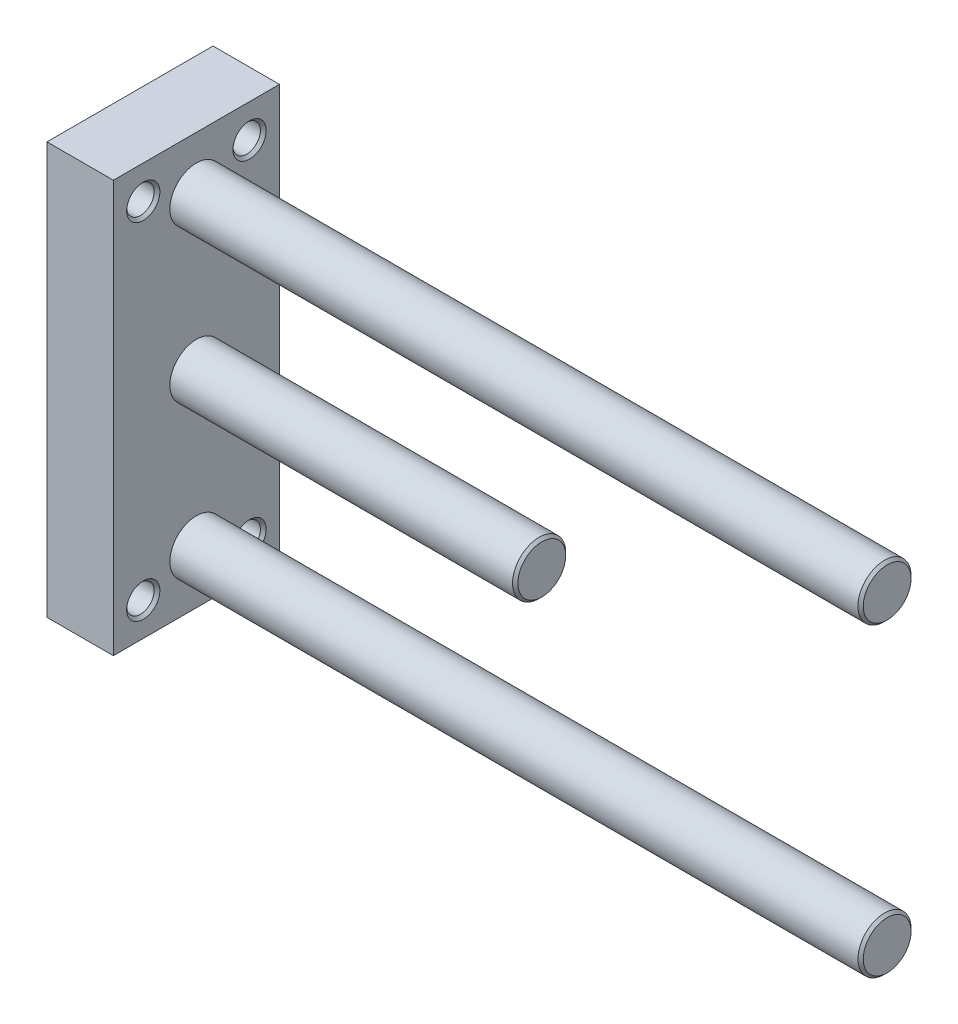
ISO-10303-21;
HEADER;
FILE_DESCRIPTION(('STEP AP214'),'2;1');
FILE_NAME('part.step','',(''),(''),'','','');
FILE_SCHEMA(('AUTOMOTIVE_DESIGN { 1 0 10303 214 1 1 1 1 }'));
ENDSEC;
DATA;
#1=APPLICATION_CONTEXT('core data for automotive mechanical design processes');
#2=APPLICATION_PROTOCOL_DEFINITION('international standard','automotive_design',2000,#1);
#3=PRODUCT_CONTEXT('',#1,'mechanical');
#4=PRODUCT('Part','Part','',(#3));
#5=PRODUCT_RELATED_PRODUCT_CATEGORY('part','',(#4));
#6=PRODUCT_DEFINITION_FORMATION('','',#4);
#7=PRODUCT_DEFINITION_CONTEXT('part definition',#1,'design');
#8=PRODUCT_DEFINITION('design','',#6,#7);
#9=PRODUCT_DEFINITION_SHAPE('','',#8);
#10=(LENGTH_UNIT() NAMED_UNIT(*) SI_UNIT(.MILLI.,.METRE.));
#11=(NAMED_UNIT(*) PLANE_ANGLE_UNIT() SI_UNIT($,.RADIAN.));
#12=(NAMED_UNIT(*) SI_UNIT($,.STERADIAN.) SOLID_ANGLE_UNIT());
#13=UNCERTAINTY_MEASURE_WITH_UNIT(LENGTH_MEASURE(1.E-05),#10,'distance_accuracy_value','');
#14=(GEOMETRIC_REPRESENTATION_CONTEXT(3) GLOBAL_UNCERTAINTY_ASSIGNED_CONTEXT((#13)) GLOBAL_UNIT_ASSIGNED_CONTEXT((#10,
#11,#12)) REPRESENTATION_CONTEXT('',''));
#15=CARTESIAN_POINT('',(0.,0.,0.));
#16=DIRECTION('',(0.,0.,1.));
#17=DIRECTION('',(1.,0.,0.));
#18=AXIS2_PLACEMENT_3D('',#15,#16,#17);
#19=CARTESIAN_POINT('',(10.,-31.,12.5));
#20=DIRECTION('',(1.,0.,0.));
#21=DIRECTION('',(0.,0.,-1.));
#22=AXIS2_PLACEMENT_3D('',#19,#20,#21);
#23=PLANE('',#22);
#24=CARTESIAN_POINT('',(9.99999999999999,-23.,0.));
#25=DIRECTION('',(-1.,0.,0.));
#26=DIRECTION('',(0.,0.,1.));
#27=AXIS2_PLACEMENT_3D('',#24,#25,#26);
#28=CIRCLE('',#27,4.);
#29=CARTESIAN_POINT('',(9.99999999999999,-23.,4.));
#30=VERTEX_POINT('',#29);
#31=EDGE_CURVE('E205',#30,#30,#28,.T.);
#32=ORIENTED_EDGE('',*,*,#31,.T.);
#33=EDGE_LOOP('',(#32));
#34=FACE_BOUND('',#33,.T.);
#35=CARTESIAN_POINT('',(10.,26.,8.));
#36=DIRECTION('',(-1.,0.,0.));
#37=DIRECTION('',(0.,0.,1.));
#38=AXIS2_PLACEMENT_3D('',#35,#36,#37);
#39=CIRCLE('',#38,2.5);
#40=CARTESIAN_POINT('',(10.,26.,10.5));
#41=VERTEX_POINT('',#40);
#42=EDGE_CURVE('E276',#41,#41,#39,.T.);
#43=ORIENTED_EDGE('',*,*,#42,.T.);
#44=EDGE_LOOP('',(#43));
#45=FACE_BOUND('',#44,.T.);
#46=CARTESIAN_POINT('',(10.,-26.,-8.));
#47=DIRECTION('',(-1.,0.,0.));
#48=DIRECTION('',(0.,0.,1.));
#49=AXIS2_PLACEMENT_3D('',#46,#47,#48);
#50=CIRCLE('',#49,2.5);
#51=CARTESIAN_POINT('',(10.,-26.,-5.5));
#52=VERTEX_POINT('',#51);
#53=EDGE_CURVE('E298',#52,#52,#50,.T.);
#54=ORIENTED_EDGE('',*,*,#53,.T.);
#55=EDGE_LOOP('',(#54));
#56=FACE_BOUND('',#55,.T.);
#57=DIRECTION('',(0.,-1.,0.));
#58=VECTOR('',#57,1.);
#59=CARTESIAN_POINT('',(10.,31.,12.5));
#60=LINE('',#59,#58);
#61=CARTESIAN_POINT('',(10.,31.,12.5));
#62=VERTEX_POINT('',#61);
#63=CARTESIAN_POINT('',(10.,-31.,12.5));
#64=VERTEX_POINT('',#63);
#65=EDGE_CURVE('E154',#62,#64,#60,.T.);
#66=ORIENTED_EDGE('',*,*,#65,.T.);
#67=DIRECTION('',(0.,0.,-1.));
#68=VECTOR('',#67,1.);
#69=CARTESIAN_POINT('',(10.,-31.,12.5));
#70=LINE('',#69,#68);
#71=CARTESIAN_POINT('',(10.,-31.,-12.5));
#72=VERTEX_POINT('',#71);
#73=EDGE_CURVE('E87',#64,#72,#70,.T.);
#74=ORIENTED_EDGE('',*,*,#73,.T.);
#75=DIRECTION('',(0.,1.,0.));
#76=VECTOR('',#75,1.);
#77=CARTESIAN_POINT('',(10.,-31.,-12.5));
#78=LINE('',#77,#76);
#79=CARTESIAN_POINT('',(10.,31.,-12.5));
#80=VERTEX_POINT('',#79);
#81=EDGE_CURVE('E150',#72,#80,#78,.T.);
#82=ORIENTED_EDGE('',*,*,#81,.T.);
#83=DIRECTION('',(0.,0.,1.));
#84=VECTOR('',#83,1.);
#85=CARTESIAN_POINT('',(10.,31.,-12.5));
#86=LINE('',#85,#84);
#87=EDGE_CURVE('E56',#80,#62,#86,.T.);
#88=ORIENTED_EDGE('',*,*,#87,.T.);
#89=EDGE_LOOP('',(#66,#74,#82,#88));
#90=FACE_BOUND('',#89,.T.);
#91=CARTESIAN_POINT('',(10.,26.,-8.));
#92=DIRECTION('',(-1.,0.,0.));
#93=DIRECTION('',(0.,0.,1.));
#94=AXIS2_PLACEMENT_3D('',#91,#92,#93);
#95=CIRCLE('',#94,2.5);
#96=CARTESIAN_POINT('',(10.,26.,-5.5));
#97=VERTEX_POINT('',#96);
#98=EDGE_CURVE('E179',#97,#97,#95,.T.);
#99=ORIENTED_EDGE('',*,*,#98,.T.);
#100=EDGE_LOOP('',(#99));
#101=FACE_BOUND('',#100,.T.);
#102=CARTESIAN_POINT('',(10.,-26.,8.));
#103=DIRECTION('',(-1.,0.,0.));
#104=DIRECTION('',(0.,0.,1.));
#105=AXIS2_PLACEMENT_3D('',#102,#103,#104);
#106=CIRCLE('',#105,2.5);
#107=CARTESIAN_POINT('',(10.,-26.,10.5));
#108=VERTEX_POINT('',#107);
#109=EDGE_CURVE('E183',#108,#108,#106,.T.);
#110=ORIENTED_EDGE('',*,*,#109,.T.);
#111=EDGE_LOOP('',(#110));
#112=FACE_BOUND('',#111,.T.);
#113=CARTESIAN_POINT('',(10.,0.,0.));
#114=DIRECTION('',(-1.,0.,0.));
#115=DIRECTION('',(0.,0.,1.));
#116=AXIS2_PLACEMENT_3D('',#113,#114,#115);
#117=CIRCLE('',#116,4.);
#118=CARTESIAN_POINT('',(10.,0.,4.));
#119=VERTEX_POINT('',#118);
#120=EDGE_CURVE('E187',#119,#119,#117,.T.);
#121=ORIENTED_EDGE('',*,*,#120,.T.);
#122=EDGE_LOOP('',(#121));
#123=FACE_BOUND('',#122,.T.);
#124=CARTESIAN_POINT('',(9.99999999999999,23.,0.));
#125=DIRECTION('',(-1.,0.,0.));
#126=DIRECTION('',(0.,0.,1.));
#127=AXIS2_PLACEMENT_3D('',#124,#125,#126);
#128=CIRCLE('',#127,4.);
#129=CARTESIAN_POINT('',(9.99999999999999,23.,4.));
#130=VERTEX_POINT('',#129);
#131=EDGE_CURVE('E190',#130,#130,#128,.T.);
#132=ORIENTED_EDGE('',*,*,#131,.T.);
#133=EDGE_LOOP('',(#132));
#134=FACE_BOUND('',#133,.T.);
#135=ADVANCED_FACE('F39',(#34,#45,#56,#90,#101,#112,#123,#134),#23,.T.);
#136=CARTESIAN_POINT('',(0.,-31.,12.5));
#137=DIRECTION('',(1.,0.,0.));
#138=DIRECTION('',(0.,0.,-1.));
#139=AXIS2_PLACEMENT_3D('',#136,#137,#138);
#140=PLANE('',#139);
#141=CARTESIAN_POINT('',(0.,0.,0.));
#142=DIRECTION('',(-1.,0.,0.));
#143=DIRECTION('',(0.,0.,1.));
#144=AXIS2_PLACEMENT_3D('',#141,#142,#143);
#145=CIRCLE('',#144,3.8);
#146=CARTESIAN_POINT('',(0.,0.,3.8));
#147=VERTEX_POINT('',#146);
#148=EDGE_CURVE('E252',#147,#147,#145,.T.);
#149=ORIENTED_EDGE('',*,*,#148,.F.);
#150=EDGE_LOOP('',(#149));
#151=FACE_BOUND('',#150,.T.);
#152=CARTESIAN_POINT('',(0.,26.,8.));
#153=DIRECTION('',(-1.,0.,0.));
#154=DIRECTION('',(0.,0.,1.));
#155=AXIS2_PLACEMENT_3D('',#152,#153,#154);
#156=CIRCLE('',#155,2.5);
#157=CARTESIAN_POINT('',(0.,26.,10.5));
#158=VERTEX_POINT('',#157);
#159=EDGE_CURVE('E285',#158,#158,#156,.T.);
#160=ORIENTED_EDGE('',*,*,#159,.F.);
#161=EDGE_LOOP('',(#160));
#162=FACE_BOUND('',#161,.T.);
#163=CARTESIAN_POINT('',(0.,-26.,-8.));
#164=DIRECTION('',(-1.,0.,0.));
#165=DIRECTION('',(0.,0.,1.));
#166=AXIS2_PLACEMENT_3D('',#163,#164,#165);
#167=CIRCLE('',#166,2.5);
#168=CARTESIAN_POINT('',(0.,-26.,-5.5));
#169=VERTEX_POINT('',#168);
#170=EDGE_CURVE('E307',#169,#169,#167,.T.);
#171=ORIENTED_EDGE('',*,*,#170,.F.);
#172=EDGE_LOOP('',(#171));
#173=FACE_BOUND('',#172,.T.);
#174=DIRECTION('',(0.,-1.,0.));
#175=VECTOR('',#174,1.);
#176=CARTESIAN_POINT('',(0.,31.,12.5));
#177=LINE('',#176,#175);
#178=CARTESIAN_POINT('',(0.,31.,12.5));
#179=VERTEX_POINT('',#178);
#180=CARTESIAN_POINT('',(0.,-31.,12.5));
#181=VERTEX_POINT('',#180);
#182=EDGE_CURVE('E148',#179,#181,#177,.T.);
#183=ORIENTED_EDGE('',*,*,#182,.F.);
#184=DIRECTION('',(0.,0.,1.));
#185=VECTOR('',#184,1.);
#186=CARTESIAN_POINT('',(0.,31.,-12.5));
#187=LINE('',#186,#185);
#188=CARTESIAN_POINT('',(0.,31.,-12.5));
#189=VERTEX_POINT('',#188);
#190=EDGE_CURVE('E80',#189,#179,#187,.T.);
#191=ORIENTED_EDGE('',*,*,#190,.F.);
#192=DIRECTION('',(0.,1.,0.));
#193=VECTOR('',#192,1.);
#194=CARTESIAN_POINT('',(0.,-31.,-12.5));
#195=LINE('',#194,#193);
#196=CARTESIAN_POINT('',(0.,-31.,-12.5));
#197=VERTEX_POINT('',#196);
#198=EDGE_CURVE('E74',#197,#189,#195,.T.);
#199=ORIENTED_EDGE('',*,*,#198,.F.);
#200=DIRECTION('',(0.,0.,-1.));
#201=VECTOR('',#200,1.);
#202=CARTESIAN_POINT('',(0.,-31.,12.5));
#203=LINE('',#202,#201);
#204=EDGE_CURVE('E142',#181,#197,#203,.T.);
#205=ORIENTED_EDGE('',*,*,#204,.F.);
#206=EDGE_LOOP('',(#183,#191,#199,#205));
#207=FACE_BOUND('',#206,.T.);
#208=CARTESIAN_POINT('',(0.,26.,-8.));
#209=DIRECTION('',(-1.,0.,0.));
#210=DIRECTION('',(0.,0.,1.));
#211=AXIS2_PLACEMENT_3D('',#208,#209,#210);
#212=CIRCLE('',#211,2.5);
#213=CARTESIAN_POINT('',(0.,26.,-5.5));
#214=VERTEX_POINT('',#213);
#215=EDGE_CURVE('E164',#214,#214,#212,.T.);
#216=ORIENTED_EDGE('',*,*,#215,.F.);
#217=EDGE_LOOP('',(#216));
#218=FACE_BOUND('',#217,.T.);
#219=CARTESIAN_POINT('',(0.,-26.,8.));
#220=DIRECTION('',(-1.,0.,0.));
#221=DIRECTION('',(0.,0.,1.));
#222=AXIS2_PLACEMENT_3D('',#219,#220,#221);
#223=CIRCLE('',#222,2.5);
#224=CARTESIAN_POINT('',(0.,-26.,10.5));
#225=VERTEX_POINT('',#224);
#226=EDGE_CURVE('E295',#225,#225,#223,.T.);
#227=ORIENTED_EDGE('',*,*,#226,.F.);
#228=EDGE_LOOP('',(#227));
#229=FACE_BOUND('',#228,.T.);
#230=CARTESIAN_POINT('',(0.,23.,0.));
#231=DIRECTION('',(-1.,0.,0.));
#232=DIRECTION('',(0.,0.,1.));
#233=AXIS2_PLACEMENT_3D('',#230,#231,#232);
#234=CIRCLE('',#233,3.8);
#235=CARTESIAN_POINT('',(0.,23.,3.8));
#236=VERTEX_POINT('',#235);
#237=EDGE_CURVE('E273',#236,#236,#234,.T.);
#238=ORIENTED_EDGE('',*,*,#237,.F.);
#239=EDGE_LOOP('',(#238));
#240=FACE_BOUND('',#239,.T.);
#241=CARTESIAN_POINT('',(0.,-23.,0.));
#242=DIRECTION('',(-1.,0.,0.));
#243=DIRECTION('',(0.,0.,1.));
#244=AXIS2_PLACEMENT_3D('',#241,#242,#243);
#245=CIRCLE('',#244,3.8);
#246=CARTESIAN_POINT('',(0.,-23.,3.8));
#247=VERTEX_POINT('',#246);
#248=EDGE_CURVE('E231',#247,#247,#245,.T.);
#249=ORIENTED_EDGE('',*,*,#248,.F.);
#250=EDGE_LOOP('',(#249));
#251=FACE_BOUND('',#250,.T.);
#252=ADVANCED_FACE('F115',(#151,#162,#173,#207,#218,#229,#240,#251),#140,.F.);
#253=CARTESIAN_POINT('',(10.,31.,12.5));
#254=DIRECTION('',(0.,0.,-1.));
#255=DIRECTION('',(-1.,0.,0.));
#256=AXIS2_PLACEMENT_3D('',#253,#254,#255);
#257=PLANE('',#256);
#258=ORIENTED_EDGE('',*,*,#182,.T.);
#259=DIRECTION('',(-1.,0.,0.));
#260=VECTOR('',#259,1.);
#261=CARTESIAN_POINT('',(10.,-31.,12.5));
#262=LINE('',#261,#260);
#263=EDGE_CURVE('E11',#64,#181,#262,.T.);
#264=ORIENTED_EDGE('',*,*,#263,.F.);
#265=ORIENTED_EDGE('',*,*,#65,.F.);
#266=DIRECTION('',(-1.,0.,0.));
#267=VECTOR('',#266,1.);
#268=CARTESIAN_POINT('',(10.,31.,12.5));
#269=LINE('',#268,#267);
#270=EDGE_CURVE('E158',#62,#179,#269,.T.);
#271=ORIENTED_EDGE('',*,*,#270,.T.);
#272=EDGE_LOOP('',(#258,#264,#265,#271));
#273=FACE_BOUND('',#272,.T.);
#274=ADVANCED_FACE('F41',(#273),#257,.F.);
#275=CARTESIAN_POINT('',(10.,-31.,12.5));
#276=DIRECTION('',(0.,1.,0.));
#277=DIRECTION('',(0.,0.,1.));
#278=AXIS2_PLACEMENT_3D('',#275,#276,#277);
#279=PLANE('',#278);
#280=ORIENTED_EDGE('',*,*,#204,.T.);
#281=DIRECTION('',(-1.,0.,0.));
#282=VECTOR('',#281,1.);
#283=CARTESIAN_POINT('',(10.,-31.,-12.5));
#284=LINE('',#283,#282);
#285=EDGE_CURVE('E48',#72,#197,#284,.T.);
#286=ORIENTED_EDGE('',*,*,#285,.F.);
#287=ORIENTED_EDGE('',*,*,#73,.F.);
#288=ORIENTED_EDGE('',*,*,#263,.T.);
#289=EDGE_LOOP('',(#280,#286,#287,#288));
#290=FACE_BOUND('',#289,.T.);
#291=ADVANCED_FACE('F136',(#290),#279,.F.);
#292=CARTESIAN_POINT('',(10.,-31.,-12.5));
#293=DIRECTION('',(0.,0.,1.));
#294=DIRECTION('',(1.,0.,0.));
#295=AXIS2_PLACEMENT_3D('',#292,#293,#294);
#296=PLANE('',#295);
#297=ORIENTED_EDGE('',*,*,#198,.T.);
#298=DIRECTION('',(-1.,0.,0.));
#299=VECTOR('',#298,1.);
#300=CARTESIAN_POINT('',(10.,31.,-12.5));
#301=LINE('',#300,#299);
#302=EDGE_CURVE('E151',#80,#189,#301,.T.);
#303=ORIENTED_EDGE('',*,*,#302,.F.);
#304=ORIENTED_EDGE('',*,*,#81,.F.);
#305=ORIENTED_EDGE('',*,*,#285,.T.);
#306=EDGE_LOOP('',(#297,#303,#304,#305));
#307=FACE_BOUND('',#306,.T.);
#308=ADVANCED_FACE('F134',(#307),#296,.F.);
#309=CARTESIAN_POINT('',(10.,31.,-12.5));
#310=DIRECTION('',(0.,-1.,0.));
#311=DIRECTION('',(0.,0.,-1.));
#312=AXIS2_PLACEMENT_3D('',#309,#310,#311);
#313=PLANE('',#312);
#314=ORIENTED_EDGE('',*,*,#190,.T.);
#315=ORIENTED_EDGE('',*,*,#270,.F.);
#316=ORIENTED_EDGE('',*,*,#87,.F.);
#317=ORIENTED_EDGE('',*,*,#302,.T.);
#318=EDGE_LOOP('',(#314,#315,#316,#317));
#319=FACE_BOUND('',#318,.T.);
#320=ADVANCED_FACE('F131',(#319),#313,.F.);
#321=CARTESIAN_POINT('',(0.432999999999999,26.,-8.));
#322=DIRECTION('',(-1.,0.,0.));
#323=DIRECTION('',(0.,0.,1.));
#324=AXIS2_PLACEMENT_3D('',#321,#322,#323);
#325=CONICAL_SURFACE('',#324,2.067,0.78539816339745);
#326=ORIENTED_EDGE('',*,*,#215,.T.);
#327=EDGE_LOOP('',(#326));
#328=FACE_BOUND('',#327,.T.);
#329=CARTESIAN_POINT('',(0.432999999999999,26.,-8.));
#330=DIRECTION('',(-1.,0.,0.));
#331=DIRECTION('',(0.,0.,1.));
#332=AXIS2_PLACEMENT_3D('',#329,#330,#331);
#333=CIRCLE('',#332,2.067);
#334=CARTESIAN_POINT('',(0.432999999999999,26.,-5.933));
#335=VERTEX_POINT('',#334);
#336=EDGE_CURVE('E166',#335,#335,#333,.T.);
#337=ORIENTED_EDGE('',*,*,#336,.F.);
#338=EDGE_LOOP('',(#337));
#339=FACE_BOUND('',#338,.T.);
#340=ADVANCED_FACE('F128',(#328,#339),#325,.F.);
#341=CARTESIAN_POINT('',(10.,26.,-8.));
#342=DIRECTION('',(-1.,0.,0.));
#343=DIRECTION('',(0.,0.,1.));
#344=AXIS2_PLACEMENT_3D('',#341,#342,#343);
#345=CYLINDRICAL_SURFACE('',#344,2.067);
#346=ORIENTED_EDGE('',*,*,#336,.T.);
#347=EDGE_LOOP('',(#346));
#348=FACE_BOUND('',#347,.T.);
#349=CARTESIAN_POINT('',(9.567,26.,-8.));
#350=DIRECTION('',(-1.,0.,0.));
#351=DIRECTION('',(0.,0.,1.));
#352=AXIS2_PLACEMENT_3D('',#349,#350,#351);
#353=CIRCLE('',#352,2.067);
#354=CARTESIAN_POINT('',(9.567,26.,-5.933));
#355=VERTEX_POINT('',#354);
#356=EDGE_CURVE('E171',#355,#355,#353,.T.);
#357=ORIENTED_EDGE('',*,*,#356,.F.);
#358=EDGE_LOOP('',(#357));
#359=FACE_BOUND('',#358,.T.);
#360=ADVANCED_FACE('F316',(#348,#359),#345,.F.);
#361=CARTESIAN_POINT('',(10.,26.,-8.));
#362=DIRECTION('',(1.,0.,0.));
#363=DIRECTION('',(0.,0.,-1.));
#364=AXIS2_PLACEMENT_3D('',#361,#362,#363);
#365=CONICAL_SURFACE('',#364,2.5,0.78539816339745);
#366=ORIENTED_EDGE('',*,*,#356,.T.);
#367=EDGE_LOOP('',(#366));
#368=FACE_BOUND('',#367,.T.);
#369=ORIENTED_EDGE('',*,*,#98,.F.);
#370=EDGE_LOOP('',(#369));
#371=FACE_BOUND('',#370,.T.);
#372=ADVANCED_FACE('F313',(#368,#371),#365,.F.);
#373=CARTESIAN_POINT('',(0.432999999999999,-26.,-8.));
#374=DIRECTION('',(-1.,0.,0.));
#375=DIRECTION('',(0.,0.,1.));
#376=AXIS2_PLACEMENT_3D('',#373,#374,#375);
#377=CONICAL_SURFACE('',#376,2.067,0.78539816339745);
#378=ORIENTED_EDGE('',*,*,#170,.T.);
#379=EDGE_LOOP('',(#378));
#380=FACE_BOUND('',#379,.T.);
#381=CARTESIAN_POINT('',(0.432999999999999,-26.,-8.));
#382=DIRECTION('',(-1.,0.,0.));
#383=DIRECTION('',(0.,0.,1.));
#384=AXIS2_PLACEMENT_3D('',#381,#382,#383);
#385=CIRCLE('',#384,2.067);
#386=CARTESIAN_POINT('',(0.432999999999999,-26.,-5.933));
#387=VERTEX_POINT('',#386);
#388=EDGE_CURVE('E304',#387,#387,#385,.T.);
#389=ORIENTED_EDGE('',*,*,#388,.F.);
#390=EDGE_LOOP('',(#389));
#391=FACE_BOUND('',#390,.T.);
#392=ADVANCED_FACE('F323',(#380,#391),#377,.F.);
#393=CARTESIAN_POINT('',(10.,-26.,-8.));
#394=DIRECTION('',(-1.,0.,0.));
#395=DIRECTION('',(0.,0.,1.));
#396=AXIS2_PLACEMENT_3D('',#393,#394,#395);
#397=CYLINDRICAL_SURFACE('',#396,2.067);
#398=ORIENTED_EDGE('',*,*,#388,.T.);
#399=EDGE_LOOP('',(#398));
#400=FACE_BOUND('',#399,.T.);
#401=CARTESIAN_POINT('',(9.567,-26.,-8.));
#402=DIRECTION('',(-1.,0.,0.));
#403=DIRECTION('',(0.,0.,1.));
#404=AXIS2_PLACEMENT_3D('',#401,#402,#403);
#405=CIRCLE('',#404,2.067);
#406=CARTESIAN_POINT('',(9.567,-26.,-5.933));
#407=VERTEX_POINT('',#406);
#408=EDGE_CURVE('E301',#407,#407,#405,.T.);
#409=ORIENTED_EDGE('',*,*,#408,.F.);
#410=EDGE_LOOP('',(#409));
#411=FACE_BOUND('',#410,.T.);
#412=ADVANCED_FACE('F328',(#400,#411),#397,.F.);
#413=CARTESIAN_POINT('',(10.,-26.,-8.));
#414=DIRECTION('',(1.,0.,0.));
#415=DIRECTION('',(0.,0.,-1.));
#416=AXIS2_PLACEMENT_3D('',#413,#414,#415);
#417=CONICAL_SURFACE('',#416,2.5,0.78539816339745);
#418=ORIENTED_EDGE('',*,*,#408,.T.);
#419=EDGE_LOOP('',(#418));
#420=FACE_BOUND('',#419,.T.);
#421=ORIENTED_EDGE('',*,*,#53,.F.);
#422=EDGE_LOOP('',(#421));
#423=FACE_BOUND('',#422,.T.);
#424=ADVANCED_FACE('F332',(#420,#423),#417,.F.);
#425=CARTESIAN_POINT('',(0.432999999999999,-26.,8.));
#426=DIRECTION('',(-1.,0.,0.));
#427=DIRECTION('',(0.,0.,1.));
#428=AXIS2_PLACEMENT_3D('',#425,#426,#427);
#429=CONICAL_SURFACE('',#428,2.067,0.78539816339745);
#430=ORIENTED_EDGE('',*,*,#226,.T.);
#431=EDGE_LOOP('',(#430));
#432=FACE_BOUND('',#431,.T.);
#433=CARTESIAN_POINT('',(0.432999999999999,-26.,8.));
#434=DIRECTION('',(-1.,0.,0.));
#435=DIRECTION('',(0.,0.,1.));
#436=AXIS2_PLACEMENT_3D('',#433,#434,#435);
#437=CIRCLE('',#436,2.067);
#438=CARTESIAN_POINT('',(0.432999999999999,-26.,10.067));
#439=VERTEX_POINT('',#438);
#440=EDGE_CURVE('E292',#439,#439,#437,.T.);
#441=ORIENTED_EDGE('',*,*,#440,.F.);
#442=EDGE_LOOP('',(#441));
#443=FACE_BOUND('',#442,.T.);
#444=ADVANCED_FACE('F336',(#432,#443),#429,.F.);
#445=CARTESIAN_POINT('',(10.,-26.,8.));
#446=DIRECTION('',(-1.,0.,0.));
#447=DIRECTION('',(0.,0.,1.));
#448=AXIS2_PLACEMENT_3D('',#445,#446,#447);
#449=CYLINDRICAL_SURFACE('',#448,2.067);
#450=ORIENTED_EDGE('',*,*,#440,.T.);
#451=EDGE_LOOP('',(#450));
#452=FACE_BOUND('',#451,.T.);
#453=CARTESIAN_POINT('',(9.567,-26.,8.));
#454=DIRECTION('',(-1.,0.,0.));
#455=DIRECTION('',(0.,0.,1.));
#456=AXIS2_PLACEMENT_3D('',#453,#454,#455);
#457=CIRCLE('',#456,2.067);
#458=CARTESIAN_POINT('',(9.567,-26.,10.067));
#459=VERTEX_POINT('',#458);
#460=EDGE_CURVE('E289',#459,#459,#457,.T.);
#461=ORIENTED_EDGE('',*,*,#460,.F.);
#462=EDGE_LOOP('',(#461));
#463=FACE_BOUND('',#462,.T.);
#464=ADVANCED_FACE('F340',(#452,#463),#449,.F.);
#465=CARTESIAN_POINT('',(10.,-26.,8.));
#466=DIRECTION('',(1.,0.,0.));
#467=DIRECTION('',(0.,0.,-1.));
#468=AXIS2_PLACEMENT_3D('',#465,#466,#467);
#469=CONICAL_SURFACE('',#468,2.5,0.78539816339745);
#470=ORIENTED_EDGE('',*,*,#460,.T.);
#471=EDGE_LOOP('',(#470));
#472=FACE_BOUND('',#471,.T.);
#473=ORIENTED_EDGE('',*,*,#109,.F.);
#474=EDGE_LOOP('',(#473));
#475=FACE_BOUND('',#474,.T.);
#476=ADVANCED_FACE('F344',(#472,#475),#469,.F.);
#477=CARTESIAN_POINT('',(0.432999999999999,26.,8.));
#478=DIRECTION('',(-1.,0.,0.));
#479=DIRECTION('',(0.,0.,1.));
#480=AXIS2_PLACEMENT_3D('',#477,#478,#479);
#481=CONICAL_SURFACE('',#480,2.067,0.78539816339745);
#482=ORIENTED_EDGE('',*,*,#159,.T.);
#483=EDGE_LOOP('',(#482));
#484=FACE_BOUND('',#483,.T.);
#485=CARTESIAN_POINT('',(0.432999999999999,26.,8.));
#486=DIRECTION('',(-1.,0.,0.));
#487=DIRECTION('',(0.,0.,1.));
#488=AXIS2_PLACEMENT_3D('',#485,#486,#487);
#489=CIRCLE('',#488,2.067);
#490=CARTESIAN_POINT('',(0.432999999999999,26.,10.067));
#491=VERTEX_POINT('',#490);
#492=EDGE_CURVE('E282',#491,#491,#489,.T.);
#493=ORIENTED_EDGE('',*,*,#492,.F.);
#494=EDGE_LOOP('',(#493));
#495=FACE_BOUND('',#494,.T.);
#496=ADVANCED_FACE('F348',(#484,#495),#481,.F.);
#497=CARTESIAN_POINT('',(10.,26.,8.));
#498=DIRECTION('',(-1.,0.,0.));
#499=DIRECTION('',(0.,0.,1.));
#500=AXIS2_PLACEMENT_3D('',#497,#498,#499);
#501=CYLINDRICAL_SURFACE('',#500,2.067);
#502=ORIENTED_EDGE('',*,*,#492,.T.);
#503=EDGE_LOOP('',(#502));
#504=FACE_BOUND('',#503,.T.);
#505=CARTESIAN_POINT('',(9.567,26.,8.));
#506=DIRECTION('',(-1.,0.,0.));
#507=DIRECTION('',(0.,0.,1.));
#508=AXIS2_PLACEMENT_3D('',#505,#506,#507);
#509=CIRCLE('',#508,2.067);
#510=CARTESIAN_POINT('',(9.567,26.,10.067));
#511=VERTEX_POINT('',#510);
#512=EDGE_CURVE('E279',#511,#511,#509,.T.);
#513=ORIENTED_EDGE('',*,*,#512,.F.);
#514=EDGE_LOOP('',(#513));
#515=FACE_BOUND('',#514,.T.);
#516=ADVANCED_FACE('F352',(#504,#515),#501,.F.);
#517=CARTESIAN_POINT('',(10.,26.,8.));
#518=DIRECTION('',(1.,0.,0.));
#519=DIRECTION('',(0.,0.,-1.));
#520=AXIS2_PLACEMENT_3D('',#517,#518,#519);
#521=CONICAL_SURFACE('',#520,2.5,0.78539816339745);
#522=ORIENTED_EDGE('',*,*,#512,.T.);
#523=EDGE_LOOP('',(#522));
#524=FACE_BOUND('',#523,.T.);
#525=ORIENTED_EDGE('',*,*,#42,.F.);
#526=EDGE_LOOP('',(#525));
#527=FACE_BOUND('',#526,.T.);
#528=ADVANCED_FACE('F356',(#524,#527),#521,.F.);
#529=CARTESIAN_POINT('',(5.02158095934,23.,0.));
#530=DIRECTION('',(-1.,0.,0.));
#531=DIRECTION('',(0.,0.,1.));
#532=AXIS2_PLACEMENT_3D('',#529,#530,#531);
#533=CYLINDRICAL_SURFACE('',#532,3.8);
#534=ORIENTED_EDGE('',*,*,#237,.T.);
#535=EDGE_LOOP('',(#534));
#536=FACE_BOUND('',#535,.T.);
#537=CARTESIAN_POINT('',(5.5555555555556,23.,0.));
#538=DIRECTION('',(-1.,0.,0.));
#539=DIRECTION('',(0.,0.,1.));
#540=AXIS2_PLACEMENT_3D('',#537,#538,#539);
#541=CIRCLE('',#540,3.8);
#542=CARTESIAN_POINT('',(5.5555555555556,23.,3.8));
#543=VERTEX_POINT('',#542);
#544=EDGE_CURVE('E270',#543,#543,#541,.T.);
#545=ORIENTED_EDGE('',*,*,#544,.F.);
#546=EDGE_LOOP('',(#545));
#547=FACE_BOUND('',#546,.T.);
#548=ADVANCED_FACE('F360',(#536,#547),#533,.F.);
#549=CARTESIAN_POINT('',(5.5555555555556,23.,-3.8));
#550=DIRECTION('',(-1.,0.,0.));
#551=DIRECTION('',(0.,0.,1.));
#552=AXIS2_PLACEMENT_3D('',#549,#550,#551);
#553=PLANE('',#552);
#554=ORIENTED_EDGE('',*,*,#544,.T.);
#555=EDGE_LOOP('',(#554));
#556=FACE_BOUND('',#555,.T.);
#557=CARTESIAN_POINT('',(5.5555555555556,23.,0.));
#558=DIRECTION('',(-1.,0.,0.));
#559=DIRECTION('',(0.,0.,1.));
#560=AXIS2_PLACEMENT_3D('',#557,#558,#559);
#561=CIRCLE('',#560,3.5);
#562=CARTESIAN_POINT('',(5.5555555555556,23.,3.5));
#563=VERTEX_POINT('',#562);
#564=EDGE_CURVE('E267',#563,#563,#561,.T.);
#565=ORIENTED_EDGE('',*,*,#564,.F.);
#566=EDGE_LOOP('',(#565));
#567=FACE_BOUND('',#566,.T.);
#568=ADVANCED_FACE('F364',(#556,#567),#553,.T.);
#569=CARTESIAN_POINT('',(5.02158095934,23.,0.));
#570=DIRECTION('',(-1.,0.,0.));
#571=DIRECTION('',(0.,0.,1.));
#572=AXIS2_PLACEMENT_3D('',#569,#570,#571);
#573=CYLINDRICAL_SURFACE('',#572,3.5);
#574=ORIENTED_EDGE('',*,*,#564,.T.);
#575=EDGE_LOOP('',(#574));
#576=FACE_BOUND('',#575,.T.);
#577=CARTESIAN_POINT('',(2.0555555555556,23.,0.));
#578=DIRECTION('',(-1.,0.,0.));
#579=DIRECTION('',(0.,0.,1.));
#580=AXIS2_PLACEMENT_3D('',#577,#578,#579);
#581=CIRCLE('',#580,3.5);
#582=CARTESIAN_POINT('',(2.0555555555556,23.,3.5));
#583=VERTEX_POINT('',#582);
#584=EDGE_CURVE('E264',#583,#583,#581,.T.);
#585=ORIENTED_EDGE('',*,*,#584,.F.);
#586=EDGE_LOOP('',(#585));
#587=FACE_BOUND('',#586,.T.);
#588=ADVANCED_FACE('F368',(#576,#587),#573,.T.);
#589=CARTESIAN_POINT('',(1.5555555555556,23.,0.));
#590=DIRECTION('',(1.,0.,0.));
#591=DIRECTION('',(0.,0.,-1.));
#592=AXIS2_PLACEMENT_3D('',#589,#590,#591);
#593=CONICAL_SURFACE('',#592,3.,0.785398163397448);
#594=ORIENTED_EDGE('',*,*,#584,.T.);
#595=EDGE_LOOP('',(#594));
#596=FACE_BOUND('',#595,.T.);
#597=CARTESIAN_POINT('',(1.5555555555556,23.,0.));
#598=DIRECTION('',(-1.,0.,0.));
#599=DIRECTION('',(0.,0.,1.));
#600=AXIS2_PLACEMENT_3D('',#597,#598,#599);
#601=CIRCLE('',#600,3.);
#602=CARTESIAN_POINT('',(1.5555555555556,23.,3.));
#603=VERTEX_POINT('',#602);
#604=EDGE_CURVE('E261',#603,#603,#601,.T.);
#605=ORIENTED_EDGE('',*,*,#604,.F.);
#606=EDGE_LOOP('',(#605));
#607=FACE_BOUND('',#606,.T.);
#608=ADVANCED_FACE('F372',(#596,#607),#593,.T.);
#609=CARTESIAN_POINT('',(1.5555555555556,23.,-3.));
#610=DIRECTION('',(-1.,0.,0.));
#611=DIRECTION('',(0.,0.,1.));
#612=AXIS2_PLACEMENT_3D('',#609,#610,#611);
#613=PLANE('',#612);
#614=ORIENTED_EDGE('',*,*,#604,.T.);
#615=EDGE_LOOP('',(#614));
#616=FACE_BOUND('',#615,.T.);
#617=CARTESIAN_POINT('',(1.5555555555556,23.,0.));
#618=DIRECTION('',(-1.,0.,0.));
#619=DIRECTION('',(0.,0.,1.));
#620=AXIS2_PLACEMENT_3D('',#617,#618,#619);
#621=CIRCLE('',#620,1.5);
#622=CARTESIAN_POINT('',(1.5555555555556,23.,1.5));
#623=VERTEX_POINT('',#622);
#624=EDGE_CURVE('E258',#623,#623,#621,.T.);
#625=ORIENTED_EDGE('',*,*,#624,.F.);
#626=EDGE_LOOP('',(#625));
#627=FACE_BOUND('',#626,.T.);
#628=ADVANCED_FACE('F376',(#616,#627),#613,.T.);
#629=CARTESIAN_POINT('',(5.02158095934,23.,0.));
#630=DIRECTION('',(-1.,0.,0.));
#631=DIRECTION('',(0.,0.,1.));
#632=AXIS2_PLACEMENT_3D('',#629,#630,#631);
#633=CYLINDRICAL_SURFACE('',#632,1.5);
#634=ORIENTED_EDGE('',*,*,#624,.T.);
#635=EDGE_LOOP('',(#634));
#636=FACE_BOUND('',#635,.T.);
#637=CARTESIAN_POINT('',(4.1555555555556,23.,0.));
#638=DIRECTION('',(-1.,0.,0.));
#639=DIRECTION('',(0.,0.,1.));
#640=AXIS2_PLACEMENT_3D('',#637,#638,#639);
#641=CIRCLE('',#640,1.5);
#642=CARTESIAN_POINT('',(4.1555555555556,23.,1.5));
#643=VERTEX_POINT('',#642);
#644=EDGE_CURVE('E255',#643,#643,#641,.T.);
#645=ORIENTED_EDGE('',*,*,#644,.F.);
#646=EDGE_LOOP('',(#645));
#647=FACE_BOUND('',#646,.T.);
#648=ADVANCED_FACE('F380',(#636,#647),#633,.F.);
#649=CARTESIAN_POINT('',(5.02158095934,23.,0.));
#650=DIRECTION('',(-1.,0.,0.));
#651=DIRECTION('',(0.,0.,1.));
#652=AXIS2_PLACEMENT_3D('',#649,#650,#651);
#653=CONICAL_SURFACE('',#652,0.,1.04719755119662);
#654=ORIENTED_EDGE('',*,*,#644,.T.);
#655=EDGE_LOOP('',(#654));
#656=FACE_BOUND('',#655,.T.);
#657=CARTESIAN_POINT('',(5.02158095934,23.,0.));
#658=VERTEX_POINT('',#657);
#659=VERTEX_LOOP('',#658);
#660=FACE_BOUND('',#659,.T.);
#661=ADVANCED_FACE('F384',(#656,#660),#653,.F.);
#662=CARTESIAN_POINT('',(5.02158095934,0.,0.));
#663=DIRECTION('',(-1.,0.,0.));
#664=DIRECTION('',(0.,0.,1.));
#665=AXIS2_PLACEMENT_3D('',#662,#663,#664);
#666=CYLINDRICAL_SURFACE('',#665,3.8);
#667=ORIENTED_EDGE('',*,*,#148,.T.);
#668=EDGE_LOOP('',(#667));
#669=FACE_BOUND('',#668,.T.);
#670=CARTESIAN_POINT('',(5.5555555555556,0.,0.));
#671=DIRECTION('',(-1.,0.,0.));
#672=DIRECTION('',(0.,0.,1.));
#673=AXIS2_PLACEMENT_3D('',#670,#671,#672);
#674=CIRCLE('',#673,3.8);
#675=CARTESIAN_POINT('',(5.5555555555556,0.,3.8));
#676=VERTEX_POINT('',#675);
#677=EDGE_CURVE('E249',#676,#676,#674,.T.);
#678=ORIENTED_EDGE('',*,*,#677,.F.);
#679=EDGE_LOOP('',(#678));
#680=FACE_BOUND('',#679,.T.);
#681=ADVANCED_FACE('F388',(#669,#680),#666,.F.);
#682=CARTESIAN_POINT('',(5.5555555555556,0.,-3.8));
#683=DIRECTION('',(-1.,0.,0.));
#684=DIRECTION('',(0.,0.,1.));
#685=AXIS2_PLACEMENT_3D('',#682,#683,#684);
#686=PLANE('',#685);
#687=ORIENTED_EDGE('',*,*,#677,.T.);
#688=EDGE_LOOP('',(#687));
#689=FACE_BOUND('',#688,.T.);
#690=CARTESIAN_POINT('',(5.5555555555556,0.,0.));
#691=DIRECTION('',(-1.,0.,0.));
#692=DIRECTION('',(0.,0.,1.));
#693=AXIS2_PLACEMENT_3D('',#690,#691,#692);
#694=CIRCLE('',#693,3.5);
#695=CARTESIAN_POINT('',(5.5555555555556,0.,3.5));
#696=VERTEX_POINT('',#695);
#697=EDGE_CURVE('E246',#696,#696,#694,.T.);
#698=ORIENTED_EDGE('',*,*,#697,.F.);
#699=EDGE_LOOP('',(#698));
#700=FACE_BOUND('',#699,.T.);
#701=ADVANCED_FACE('F392',(#689,#700),#686,.T.);
#702=CARTESIAN_POINT('',(5.02158095934,0.,0.));
#703=DIRECTION('',(-1.,0.,0.));
#704=DIRECTION('',(0.,0.,1.));
#705=AXIS2_PLACEMENT_3D('',#702,#703,#704);
#706=CYLINDRICAL_SURFACE('',#705,3.5);
#707=ORIENTED_EDGE('',*,*,#697,.T.);
#708=EDGE_LOOP('',(#707));
#709=FACE_BOUND('',#708,.T.);
#710=CARTESIAN_POINT('',(2.0555555555556,0.,0.));
#711=DIRECTION('',(-1.,0.,0.));
#712=DIRECTION('',(0.,0.,1.));
#713=AXIS2_PLACEMENT_3D('',#710,#711,#712);
#714=CIRCLE('',#713,3.5);
#715=CARTESIAN_POINT('',(2.0555555555556,0.,3.5));
#716=VERTEX_POINT('',#715);
#717=EDGE_CURVE('E243',#716,#716,#714,.T.);
#718=ORIENTED_EDGE('',*,*,#717,.F.);
#719=EDGE_LOOP('',(#718));
#720=FACE_BOUND('',#719,.T.);
#721=ADVANCED_FACE('F396',(#709,#720),#706,.T.);
#722=CARTESIAN_POINT('',(1.5555555555556,0.,0.));
#723=DIRECTION('',(1.,0.,0.));
#724=DIRECTION('',(0.,0.,-1.));
#725=AXIS2_PLACEMENT_3D('',#722,#723,#724);
#726=CONICAL_SURFACE('',#725,3.,0.785398163397448);
#727=ORIENTED_EDGE('',*,*,#717,.T.);
#728=EDGE_LOOP('',(#727));
#729=FACE_BOUND('',#728,.T.);
#730=CARTESIAN_POINT('',(1.5555555555556,0.,0.));
#731=DIRECTION('',(-1.,0.,0.));
#732=DIRECTION('',(0.,0.,1.));
#733=AXIS2_PLACEMENT_3D('',#730,#731,#732);
#734=CIRCLE('',#733,3.);
#735=CARTESIAN_POINT('',(1.5555555555556,0.,3.));
#736=VERTEX_POINT('',#735);
#737=EDGE_CURVE('E240',#736,#736,#734,.T.);
#738=ORIENTED_EDGE('',*,*,#737,.F.);
#739=EDGE_LOOP('',(#738));
#740=FACE_BOUND('',#739,.T.);
#741=ADVANCED_FACE('F400',(#729,#740),#726,.T.);
#742=CARTESIAN_POINT('',(1.5555555555556,0.,-3.));
#743=DIRECTION('',(-1.,0.,0.));
#744=DIRECTION('',(0.,0.,1.));
#745=AXIS2_PLACEMENT_3D('',#742,#743,#744);
#746=PLANE('',#745);
#747=ORIENTED_EDGE('',*,*,#737,.T.);
#748=EDGE_LOOP('',(#747));
#749=FACE_BOUND('',#748,.T.);
#750=CARTESIAN_POINT('',(1.5555555555556,0.,0.));
#751=DIRECTION('',(-1.,0.,0.));
#752=DIRECTION('',(0.,0.,1.));
#753=AXIS2_PLACEMENT_3D('',#750,#751,#752);
#754=CIRCLE('',#753,1.5);
#755=CARTESIAN_POINT('',(1.5555555555556,0.,1.5));
#756=VERTEX_POINT('',#755);
#757=EDGE_CURVE('E237',#756,#756,#754,.T.);
#758=ORIENTED_EDGE('',*,*,#757,.F.);
#759=EDGE_LOOP('',(#758));
#760=FACE_BOUND('',#759,.T.);
#761=ADVANCED_FACE('F404',(#749,#760),#746,.T.);
#762=CARTESIAN_POINT('',(5.02158095934,0.,0.));
#763=DIRECTION('',(-1.,0.,0.));
#764=DIRECTION('',(0.,0.,1.));
#765=AXIS2_PLACEMENT_3D('',#762,#763,#764);
#766=CYLINDRICAL_SURFACE('',#765,1.5);
#767=ORIENTED_EDGE('',*,*,#757,.T.);
#768=EDGE_LOOP('',(#767));
#769=FACE_BOUND('',#768,.T.);
#770=CARTESIAN_POINT('',(4.1555555555556,0.,0.));
#771=DIRECTION('',(-1.,0.,0.));
#772=DIRECTION('',(0.,0.,1.));
#773=AXIS2_PLACEMENT_3D('',#770,#771,#772);
#774=CIRCLE('',#773,1.5);
#775=CARTESIAN_POINT('',(4.1555555555556,0.,1.5));
#776=VERTEX_POINT('',#775);
#777=EDGE_CURVE('E234',#776,#776,#774,.T.);
#778=ORIENTED_EDGE('',*,*,#777,.F.);
#779=EDGE_LOOP('',(#778));
#780=FACE_BOUND('',#779,.T.);
#781=ADVANCED_FACE('F408',(#769,#780),#766,.F.);
#782=CARTESIAN_POINT('',(5.02158095934,0.,0.));
#783=DIRECTION('',(-1.,0.,0.));
#784=DIRECTION('',(0.,0.,1.));
#785=AXIS2_PLACEMENT_3D('',#782,#783,#784);
#786=CONICAL_SURFACE('',#785,0.,1.04719755119662);
#787=ORIENTED_EDGE('',*,*,#777,.T.);
#788=EDGE_LOOP('',(#787));
#789=FACE_BOUND('',#788,.T.);
#790=CARTESIAN_POINT('',(5.02158095934,0.,0.));
#791=VERTEX_POINT('',#790);
#792=VERTEX_LOOP('',#791);
#793=FACE_BOUND('',#792,.T.);
#794=ADVANCED_FACE('F412',(#789,#793),#786,.F.);
#795=CARTESIAN_POINT('',(5.02158095934,-23.,0.));
#796=DIRECTION('',(-1.,0.,0.));
#797=DIRECTION('',(0.,0.,1.));
#798=AXIS2_PLACEMENT_3D('',#795,#796,#797);
#799=CYLINDRICAL_SURFACE('',#798,3.8);
#800=ORIENTED_EDGE('',*,*,#248,.T.);
#801=EDGE_LOOP('',(#800));
#802=FACE_BOUND('',#801,.T.);
#803=CARTESIAN_POINT('',(5.5555555555556,-23.,0.));
#804=DIRECTION('',(-1.,0.,0.));
#805=DIRECTION('',(0.,0.,1.));
#806=AXIS2_PLACEMENT_3D('',#803,#804,#805);
#807=CIRCLE('',#806,3.8);
#808=CARTESIAN_POINT('',(5.5555555555556,-23.,3.8));
#809=VERTEX_POINT('',#808);
#810=EDGE_CURVE('E228',#809,#809,#807,.T.);
#811=ORIENTED_EDGE('',*,*,#810,.F.);
#812=EDGE_LOOP('',(#811));
#813=FACE_BOUND('',#812,.T.);
#814=ADVANCED_FACE('F416',(#802,#813),#799,.F.);
#815=CARTESIAN_POINT('',(5.5555555555556,-23.,-3.8));
#816=DIRECTION('',(-1.,0.,0.));
#817=DIRECTION('',(0.,0.,1.));
#818=AXIS2_PLACEMENT_3D('',#815,#816,#817);
#819=PLANE('',#818);
#820=ORIENTED_EDGE('',*,*,#810,.T.);
#821=EDGE_LOOP('',(#820));
#822=FACE_BOUND('',#821,.T.);
#823=CARTESIAN_POINT('',(5.5555555555556,-23.,0.));
#824=DIRECTION('',(-1.,0.,0.));
#825=DIRECTION('',(0.,0.,1.));
#826=AXIS2_PLACEMENT_3D('',#823,#824,#825);
#827=CIRCLE('',#826,3.5);
#828=CARTESIAN_POINT('',(5.5555555555556,-23.,3.5));
#829=VERTEX_POINT('',#828);
#830=EDGE_CURVE('E225',#829,#829,#827,.T.);
#831=ORIENTED_EDGE('',*,*,#830,.F.);
#832=EDGE_LOOP('',(#831));
#833=FACE_BOUND('',#832,.T.);
#834=ADVANCED_FACE('F420',(#822,#833),#819,.T.);
#835=CARTESIAN_POINT('',(5.02158095934,-23.,0.));
#836=DIRECTION('',(-1.,0.,0.));
#837=DIRECTION('',(0.,0.,1.));
#838=AXIS2_PLACEMENT_3D('',#835,#836,#837);
#839=CYLINDRICAL_SURFACE('',#838,3.5);
#840=ORIENTED_EDGE('',*,*,#830,.T.);
#841=EDGE_LOOP('',(#840));
#842=FACE_BOUND('',#841,.T.);
#843=CARTESIAN_POINT('',(2.0555555555556,-23.,0.));
#844=DIRECTION('',(-1.,0.,0.));
#845=DIRECTION('',(0.,0.,1.));
#846=AXIS2_PLACEMENT_3D('',#843,#844,#845);
#847=CIRCLE('',#846,3.5);
#848=CARTESIAN_POINT('',(2.0555555555556,-23.,3.5));
#849=VERTEX_POINT('',#848);
#850=EDGE_CURVE('E222',#849,#849,#847,.T.);
#851=ORIENTED_EDGE('',*,*,#850,.F.);
#852=EDGE_LOOP('',(#851));
#853=FACE_BOUND('',#852,.T.);
#854=ADVANCED_FACE('F424',(#842,#853),#839,.T.);
#855=CARTESIAN_POINT('',(1.5555555555556,-23.,0.));
#856=DIRECTION('',(1.,0.,0.));
#857=DIRECTION('',(0.,0.,-1.));
#858=AXIS2_PLACEMENT_3D('',#855,#856,#857);
#859=CONICAL_SURFACE('',#858,3.,0.785398163397448);
#860=ORIENTED_EDGE('',*,*,#850,.T.);
#861=EDGE_LOOP('',(#860));
#862=FACE_BOUND('',#861,.T.);
#863=CARTESIAN_POINT('',(1.5555555555556,-23.,0.));
#864=DIRECTION('',(-1.,0.,0.));
#865=DIRECTION('',(0.,0.,1.));
#866=AXIS2_PLACEMENT_3D('',#863,#864,#865);
#867=CIRCLE('',#866,3.);
#868=CARTESIAN_POINT('',(1.5555555555556,-23.,3.));
#869=VERTEX_POINT('',#868);
#870=EDGE_CURVE('E219',#869,#869,#867,.T.);
#871=ORIENTED_EDGE('',*,*,#870,.F.);
#872=EDGE_LOOP('',(#871));
#873=FACE_BOUND('',#872,.T.);
#874=ADVANCED_FACE('F428',(#862,#873),#859,.T.);
#875=CARTESIAN_POINT('',(1.5555555555556,-23.,-3.));
#876=DIRECTION('',(-1.,0.,0.));
#877=DIRECTION('',(0.,0.,1.));
#878=AXIS2_PLACEMENT_3D('',#875,#876,#877);
#879=PLANE('',#878);
#880=ORIENTED_EDGE('',*,*,#870,.T.);
#881=EDGE_LOOP('',(#880));
#882=FACE_BOUND('',#881,.T.);
#883=CARTESIAN_POINT('',(1.5555555555556,-23.,0.));
#884=DIRECTION('',(-1.,0.,0.));
#885=DIRECTION('',(0.,0.,1.));
#886=AXIS2_PLACEMENT_3D('',#883,#884,#885);
#887=CIRCLE('',#886,1.5);
#888=CARTESIAN_POINT('',(1.5555555555556,-23.,1.5));
#889=VERTEX_POINT('',#888);
#890=EDGE_CURVE('E216',#889,#889,#887,.T.);
#891=ORIENTED_EDGE('',*,*,#890,.F.);
#892=EDGE_LOOP('',(#891));
#893=FACE_BOUND('',#892,.T.);
#894=ADVANCED_FACE('F110',(#882,#893),#879,.T.);
#895=CARTESIAN_POINT('',(5.02158095934,-23.,0.));
#896=DIRECTION('',(-1.,0.,0.));
#897=DIRECTION('',(0.,0.,1.));
#898=AXIS2_PLACEMENT_3D('',#895,#896,#897);
#899=CYLINDRICAL_SURFACE('',#898,1.5);
#900=ORIENTED_EDGE('',*,*,#890,.T.);
#901=EDGE_LOOP('',(#900));
#902=FACE_BOUND('',#901,.T.);
#903=CARTESIAN_POINT('',(4.1555555555556,-23.,0.));
#904=DIRECTION('',(-1.,0.,0.));
#905=DIRECTION('',(0.,0.,1.));
#906=AXIS2_PLACEMENT_3D('',#903,#904,#905);
#907=CIRCLE('',#906,1.5);
#908=CARTESIAN_POINT('',(4.1555555555556,-23.,1.5));
#909=VERTEX_POINT('',#908);
#910=EDGE_CURVE('E214',#909,#909,#907,.T.);
#911=ORIENTED_EDGE('',*,*,#910,.F.);
#912=EDGE_LOOP('',(#911));
#913=FACE_BOUND('',#912,.T.);
#914=ADVANCED_FACE('F100',(#902,#913),#899,.F.);
#915=CARTESIAN_POINT('',(5.02158095934,-23.,0.));
#916=DIRECTION('',(-1.,0.,0.));
#917=DIRECTION('',(0.,0.,1.));
#918=AXIS2_PLACEMENT_3D('',#915,#916,#917);
#919=CONICAL_SURFACE('',#918,0.,1.04719755119662);
#920=ORIENTED_EDGE('',*,*,#910,.T.);
#921=EDGE_LOOP('',(#920));
#922=FACE_BOUND('',#921,.T.);
#923=CARTESIAN_POINT('',(5.02158095934,-23.,0.));
#924=VERTEX_POINT('',#923);
#925=VERTEX_LOOP('',#924);
#926=FACE_BOUND('',#925,.T.);
#927=ADVANCED_FACE('F97',(#922,#926),#919,.F.);
#928=CARTESIAN_POINT('',(62.,0.,0.));
#929=DIRECTION('',(-1.,0.,0.));
#930=DIRECTION('',(0.,0.,1.));
#931=AXIS2_PLACEMENT_3D('',#928,#929,#930);
#932=CYLINDRICAL_SURFACE('',#931,4.);
#933=ORIENTED_EDGE('',*,*,#120,.F.);
#934=EDGE_LOOP('',(#933));
#935=FACE_BOUND('',#934,.T.);
#936=CARTESIAN_POINT('',(61.6,0.,0.));
#937=DIRECTION('',(-1.,0.,0.));
#938=DIRECTION('',(0.,0.,1.));
#939=AXIS2_PLACEMENT_3D('',#936,#937,#938);
#940=CIRCLE('',#939,4.);
#941=CARTESIAN_POINT('',(61.6,0.,4.));
#942=VERTEX_POINT('',#941);
#943=EDGE_CURVE('E210',#942,#942,#940,.T.);
#944=ORIENTED_EDGE('',*,*,#943,.T.);
#945=EDGE_LOOP('',(#944));
#946=FACE_BOUND('',#945,.T.);
#947=ADVANCED_FACE('F99',(#935,#946),#932,.T.);
#948=CARTESIAN_POINT('',(62.,0.,0.));
#949=DIRECTION('',(-1.,0.,0.));
#950=DIRECTION('',(0.,0.,1.));
#951=AXIS2_PLACEMENT_3D('',#948,#949,#950);
#952=CONICAL_SURFACE('',#951,3.6,0.785398163397452);
#953=ORIENTED_EDGE('',*,*,#943,.F.);
#954=EDGE_LOOP('',(#953));
#955=FACE_BOUND('',#954,.T.);
#956=CARTESIAN_POINT('',(62.,0.,0.));
#957=DIRECTION('',(-1.,0.,0.));
#958=DIRECTION('',(0.,0.,1.));
#959=AXIS2_PLACEMENT_3D('',#956,#957,#958);
#960=CIRCLE('',#959,3.6);
#961=CARTESIAN_POINT('',(62.,0.,3.6));
#962=VERTEX_POINT('',#961);
#963=EDGE_CURVE('E207',#962,#962,#960,.T.);
#964=ORIENTED_EDGE('',*,*,#963,.T.);
#965=EDGE_LOOP('',(#964));
#966=FACE_BOUND('',#965,.T.);
#967=ADVANCED_FACE('F107',(#955,#966),#952,.T.);
#968=CARTESIAN_POINT('',(62.,0.,-3.6));
#969=DIRECTION('',(-1.,0.,0.));
#970=DIRECTION('',(0.,0.,1.));
#971=AXIS2_PLACEMENT_3D('',#968,#969,#970);
#972=PLANE('',#971);
#973=ORIENTED_EDGE('',*,*,#963,.F.);
#974=EDGE_LOOP('',(#973));
#975=FACE_BOUND('',#974,.T.);
#976=ADVANCED_FACE('F462',(#975),#972,.F.);
#977=CARTESIAN_POINT('',(114.,-23.,0.));
#978=DIRECTION('',(-1.,0.,0.));
#979=DIRECTION('',(0.,0.,1.));
#980=AXIS2_PLACEMENT_3D('',#977,#978,#979);
#981=CYLINDRICAL_SURFACE('',#980,4.);
#982=ORIENTED_EDGE('',*,*,#31,.F.);
#983=EDGE_LOOP('',(#982));
#984=FACE_BOUND('',#983,.T.);
#985=CARTESIAN_POINT('',(113.6,-23.,0.));
#986=DIRECTION('',(-1.,0.,0.));
#987=DIRECTION('',(0.,0.,1.));
#988=AXIS2_PLACEMENT_3D('',#985,#986,#987);
#989=CIRCLE('',#988,4.);
#990=CARTESIAN_POINT('',(113.6,-23.,4.));
#991=VERTEX_POINT('',#990);
#992=EDGE_CURVE('E196',#991,#991,#989,.T.);
#993=ORIENTED_EDGE('',*,*,#992,.T.);
#994=EDGE_LOOP('',(#993));
#995=FACE_BOUND('',#994,.T.);
#996=ADVANCED_FACE('F470',(#984,#995),#981,.T.);
#997=CARTESIAN_POINT('',(114.,-23.,0.));
#998=DIRECTION('',(-1.,0.,0.));
#999=DIRECTION('',(0.,0.,1.));
#1000=AXIS2_PLACEMENT_3D('',#997,#998,#999);
#1001=CONICAL_SURFACE('',#1000,3.6,0.785398163397452);
#1002=ORIENTED_EDGE('',*,*,#992,.F.);
#1003=EDGE_LOOP('',(#1002));
#1004=FACE_BOUND('',#1003,.T.);
#1005=CARTESIAN_POINT('',(114.,-23.,0.));
#1006=DIRECTION('',(-1.,0.,0.));
#1007=DIRECTION('',(0.,0.,1.));
#1008=AXIS2_PLACEMENT_3D('',#1005,#1006,#1007);
#1009=CIRCLE('',#1008,3.6);
#1010=CARTESIAN_POINT('',(114.,-23.,3.6));
#1011=VERTEX_POINT('',#1010);
#1012=EDGE_CURVE('E192',#1011,#1011,#1009,.T.);
#1013=ORIENTED_EDGE('',*,*,#1012,.T.);
#1014=EDGE_LOOP('',(#1013));
#1015=FACE_BOUND('',#1014,.T.);
#1016=ADVANCED_FACE('F478',(#1004,#1015),#1001,.T.);
#1017=CARTESIAN_POINT('',(114.,-23.,-3.6));
#1018=DIRECTION('',(-1.,0.,0.));
#1019=DIRECTION('',(0.,0.,1.));
#1020=AXIS2_PLACEMENT_3D('',#1017,#1018,#1019);
#1021=PLANE('',#1020);
#1022=ORIENTED_EDGE('',*,*,#1012,.F.);
#1023=EDGE_LOOP('',(#1022));
#1024=FACE_BOUND('',#1023,.T.);
#1025=ADVANCED_FACE('F486',(#1024),#1021,.F.);
#1026=CARTESIAN_POINT('',(114.,23.,0.));
#1027=DIRECTION('',(-1.,0.,0.));
#1028=DIRECTION('',(0.,0.,1.));
#1029=AXIS2_PLACEMENT_3D('',#1026,#1027,#1028);
#1030=CYLINDRICAL_SURFACE('',#1029,4.);
#1031=ORIENTED_EDGE('',*,*,#131,.F.);
#1032=EDGE_LOOP('',(#1031));
#1033=FACE_BOUND('',#1032,.T.);
#1034=CARTESIAN_POINT('',(113.6,23.,0.));
#1035=DIRECTION('',(-1.,0.,0.));
#1036=DIRECTION('',(0.,0.,1.));
#1037=AXIS2_PLACEMENT_3D('',#1034,#1035,#1036);
#1038=CIRCLE('',#1037,4.);
#1039=CARTESIAN_POINT('',(113.6,23.,4.));
#1040=VERTEX_POINT('',#1039);
#1041=EDGE_CURVE('E193',#1040,#1040,#1038,.T.);
#1042=ORIENTED_EDGE('',*,*,#1041,.T.);
#1043=EDGE_LOOP('',(#1042));
#1044=FACE_BOUND('',#1043,.T.);
#1045=ADVANCED_FACE('F492',(#1033,#1044),#1030,.T.);
#1046=CARTESIAN_POINT('',(114.,23.,0.));
#1047=DIRECTION('',(-1.,0.,0.));
#1048=DIRECTION('',(0.,0.,1.));
#1049=AXIS2_PLACEMENT_3D('',#1046,#1047,#1048);
#1050=CONICAL_SURFACE('',#1049,3.6,0.785398163397452);
#1051=ORIENTED_EDGE('',*,*,#1041,.F.);
#1052=EDGE_LOOP('',(#1051));
#1053=FACE_BOUND('',#1052,.T.);
#1054=CARTESIAN_POINT('',(114.,23.,0.));
#1055=DIRECTION('',(-1.,0.,0.));
#1056=DIRECTION('',(0.,0.,1.));
#1057=AXIS2_PLACEMENT_3D('',#1054,#1055,#1056);
#1058=CIRCLE('',#1057,3.6);
#1059=CARTESIAN_POINT('',(114.,23.,3.6));
#1060=VERTEX_POINT('',#1059);
#1061=EDGE_CURVE('E199',#1060,#1060,#1058,.T.);
#1062=ORIENTED_EDGE('',*,*,#1061,.T.);
#1063=EDGE_LOOP('',(#1062));
#1064=FACE_BOUND('',#1063,.T.);
#1065=ADVANCED_FACE('F502',(#1053,#1064),#1050,.T.);
#1066=CARTESIAN_POINT('',(114.,23.,-3.6));
#1067=DIRECTION('',(-1.,0.,0.));
#1068=DIRECTION('',(0.,0.,1.));
#1069=AXIS2_PLACEMENT_3D('',#1066,#1067,#1068);
#1070=PLANE('',#1069);
#1071=ORIENTED_EDGE('',*,*,#1061,.F.);
#1072=EDGE_LOOP('',(#1071));
#1073=FACE_BOUND('',#1072,.T.);
#1074=ADVANCED_FACE('F509',(#1073),#1070,.F.);
#1075=CLOSED_SHELL('',(#135,#252,#274,#291,#308,#320,#340,#360,#372,#392,#412,#424,#444,#464,
#476,#496,#516,#528,#548,#568,#588,#608,#628,#648,#661,#681,#701,#721,#741,#761,#781,#794,#814,
#834,#854,#874,#894,#914,#927,#947,#967,#976,#996,#1016,#1025,#1045,#1065,#1074));
#1076=MANIFOLD_SOLID_BREP('B2',#1075);
#1077=ADVANCED_BREP_SHAPE_REPRESENTATION('',(#18,#1076),#14);
#1078=SHAPE_DEFINITION_REPRESENTATION(#9,#1077);
ENDSEC;
END-ISO-10303-21;
